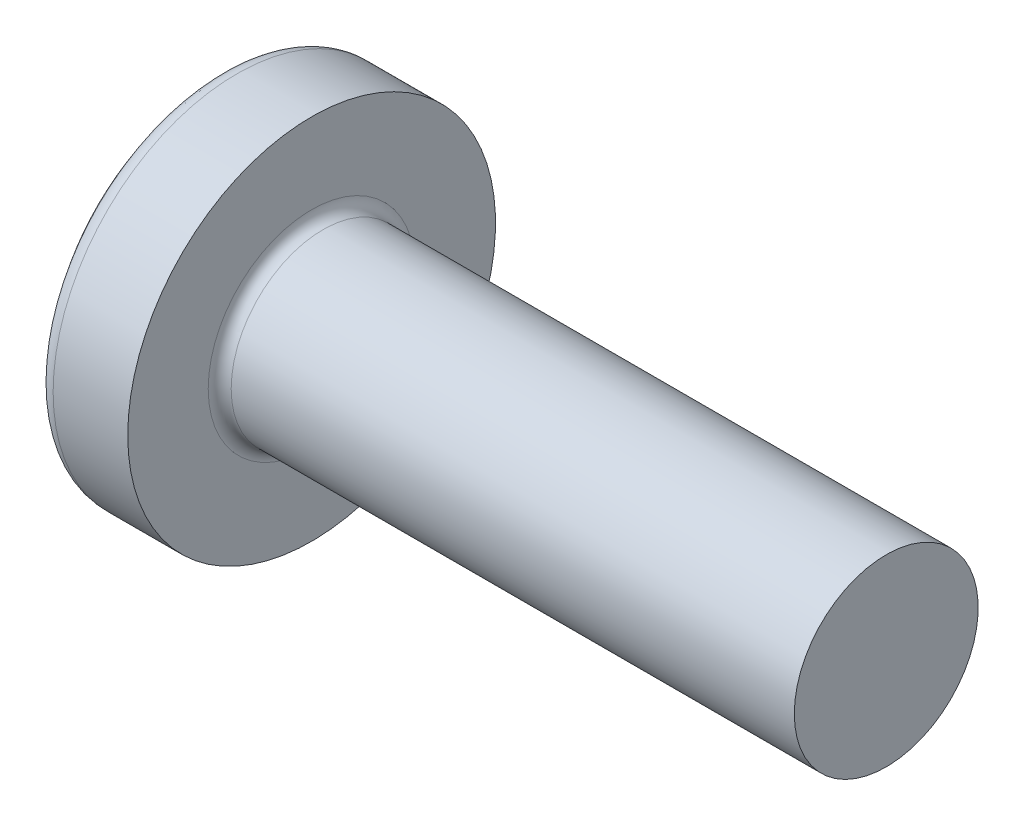
ISO-10303-21;
HEADER;
FILE_DESCRIPTION(('STEP AP214'),'2;1');
FILE_NAME('part.step','',(''),(''),'','','');
FILE_SCHEMA(('AUTOMOTIVE_DESIGN { 1 0 10303 214 1 1 1 1 }'));
ENDSEC;
DATA;
#1=APPLICATION_CONTEXT('core data for automotive mechanical design processes');
#2=APPLICATION_PROTOCOL_DEFINITION('international standard','automotive_design',2000,#1);
#3=PRODUCT_CONTEXT('',#1,'mechanical');
#4=PRODUCT('Part','Part','',(#3));
#5=PRODUCT_RELATED_PRODUCT_CATEGORY('part','',(#4));
#6=PRODUCT_DEFINITION_FORMATION('','',#4);
#7=PRODUCT_DEFINITION_CONTEXT('part definition',#1,'design');
#8=PRODUCT_DEFINITION('design','',#6,#7);
#9=PRODUCT_DEFINITION_SHAPE('','',#8);
#10=(LENGTH_UNIT() NAMED_UNIT(*) SI_UNIT(.MILLI.,.METRE.));
#11=(NAMED_UNIT(*) PLANE_ANGLE_UNIT() SI_UNIT($,.RADIAN.));
#12=(NAMED_UNIT(*) SI_UNIT($,.STERADIAN.) SOLID_ANGLE_UNIT());
#13=UNCERTAINTY_MEASURE_WITH_UNIT(LENGTH_MEASURE(1.E-05),#10,'distance_accuracy_value','');
#14=(GEOMETRIC_REPRESENTATION_CONTEXT(3) GLOBAL_UNCERTAINTY_ASSIGNED_CONTEXT((#13)) GLOBAL_UNIT_ASSIGNED_CONTEXT((#10,
#11,#12)) REPRESENTATION_CONTEXT('',''));
#15=CARTESIAN_POINT('',(0.,0.,0.));
#16=DIRECTION('',(0.,0.,1.));
#17=DIRECTION('',(1.,0.,0.));
#18=AXIS2_PLACEMENT_3D('',#15,#16,#17);
#19=CARTESIAN_POINT('',(2.5,0.,0.));
#20=DIRECTION('',(-1.,0.,0.));
#21=DIRECTION('',(0.,1.,0.));
#22=AXIS2_PLACEMENT_3D('',#19,#20,#21);
#23=SPHERICAL_SURFACE('',#22,2.5);
#24=CARTESIAN_POINT('',(0.532633828839689,0.,0.));
#25=DIRECTION('',(-1.,0.,0.));
#26=DIRECTION('',(0.,0.,1.));
#27=AXIS2_PLACEMENT_3D('',#24,#25,#26);
#28=CIRCLE('',#27,1.54255319148936);
#29=CARTESIAN_POINT('',(0.532633828839689,0.,1.54255319148936));
#30=VERTEX_POINT('',#29);
#31=EDGE_CURVE('E241',#30,#30,#28,.T.);
#32=ORIENTED_EDGE('',*,*,#31,.T.);
#33=EDGE_LOOP('',(#32));
#34=FACE_BOUND('',#33,.T.);
#35=CARTESIAN_POINT('',(0.0348536438778161,0.,0.));
#36=DIRECTION('',(1.,0.,0.));
#37=DIRECTION('',(0.,0.,-1.));
#38=AXIS2_PLACEMENT_3D('',#35,#36,#37);
#39=CIRCLE('',#38,0.415996926548163);
#40=CARTESIAN_POINT('',(0.0348536438778156,-0.239999999999999,-0.339784406495528));
#41=VERTEX_POINT('',#40);
#42=CARTESIAN_POINT('',(0.0348536438778159,-0.339784406495529,-0.24));
#43=VERTEX_POINT('',#42);
#44=EDGE_CURVE('E377',#41,#43,#39,.F.);
#45=ORIENTED_EDGE('',*,*,#44,.F.);
#46=CARTESIAN_POINT('',(2.5,-0.24,0.));
#47=DIRECTION('',(0.,1.,0.));
#48=DIRECTION('',(0.,0.,1.));
#49=AXIS2_PLACEMENT_3D('',#46,#47,#48);
#50=CIRCLE('',#49,2.48845333490504);
#51=CARTESIAN_POINT('',(0.123613677820939,-0.239999999999997,-0.738368504041365));
#52=VERTEX_POINT('',#51);
#53=EDGE_CURVE('E303',#52,#41,#50,.T.);
#54=ORIENTED_EDGE('',*,*,#53,.F.);
#55=CARTESIAN_POINT('',(2.32172308413752,0.,0.357568235162189));
#56=DIRECTION('',(0.446197753347436,0.,-0.894934391398443));
#57=DIRECTION('',(-0.894934391398443,0.,-0.446197753347436));
#58=AXIS2_PLACEMENT_3D('',#55,#56,#57);
#59=CIRCLE('',#58,2.46786594013402);
#60=CARTESIAN_POINT('',(0.123613677820939,0.240000000000003,-0.738368504041364));
#61=VERTEX_POINT('',#60);
#62=EDGE_CURVE('E275',#52,#61,#59,.T.);
#63=ORIENTED_EDGE('',*,*,#62,.T.);
#64=CARTESIAN_POINT('',(2.5,0.24,0.));
#65=DIRECTION('',(0.,-1.,0.));
#66=DIRECTION('',(0.,0.,-1.));
#67=AXIS2_PLACEMENT_3D('',#64,#65,#66);
#68=CIRCLE('',#67,2.48845333490504);
#69=CARTESIAN_POINT('',(0.0348536438778155,0.240000000000001,-0.339784406495526));
#70=VERTEX_POINT('',#69);
#71=EDGE_CURVE('E330',#70,#61,#68,.T.);
#72=ORIENTED_EDGE('',*,*,#71,.F.);
#73=CARTESIAN_POINT('',(0.0348536438778159,0.339784406495528,-0.24));
#74=VERTEX_POINT('',#73);
#75=EDGE_CURVE('E396',#74,#70,#39,.F.);
#76=ORIENTED_EDGE('',*,*,#75,.F.);
#77=CARTESIAN_POINT('',(2.5,0.,-0.24));
#78=DIRECTION('',(0.,0.,1.));
#79=DIRECTION('',(0.,-1.,0.));
#80=AXIS2_PLACEMENT_3D('',#77,#78,#79);
#81=CIRCLE('',#80,2.48845333490504);
#82=CARTESIAN_POINT('',(0.12361367782094,0.738368504041364,-0.24));
#83=VERTEX_POINT('',#82);
#84=EDGE_CURVE('E269',#83,#74,#81,.T.);
#85=ORIENTED_EDGE('',*,*,#84,.F.);
#86=CARTESIAN_POINT('',(2.32172308413752,-0.357568235162189,0.));
#87=DIRECTION('',(0.446197753347436,0.894934391398443,0.));
#88=DIRECTION('',(-0.894934391398443,0.446197753347436,0.));
#89=AXIS2_PLACEMENT_3D('',#86,#87,#88);
#90=CIRCLE('',#89,2.46786594013402);
#91=CARTESIAN_POINT('',(0.12361367782094,0.738368504041364,0.24));
#92=VERTEX_POINT('',#91);
#93=EDGE_CURVE('E272',#83,#92,#90,.T.);
#94=ORIENTED_EDGE('',*,*,#93,.T.);
#95=CARTESIAN_POINT('',(2.5,0.,0.24));
#96=DIRECTION('',(0.,0.,-1.));
#97=DIRECTION('',(0.,1.,0.));
#98=AXIS2_PLACEMENT_3D('',#95,#96,#97);
#99=CIRCLE('',#98,2.48845333490504);
#100=CARTESIAN_POINT('',(0.0348536438778159,0.339784406495528,0.24));
#101=VERTEX_POINT('',#100);
#102=EDGE_CURVE('E265',#101,#92,#99,.T.);
#103=ORIENTED_EDGE('',*,*,#102,.F.);
#104=CARTESIAN_POINT('',(0.0348536438778156,0.239999999999999,0.339784406495528));
#105=VERTEX_POINT('',#104);
#106=EDGE_CURVE('E430',#105,#101,#39,.F.);
#107=ORIENTED_EDGE('',*,*,#106,.F.);
#108=CARTESIAN_POINT('',(0.12361367782094,0.239999999999997,0.738368504041365));
#109=VERTEX_POINT('',#108);
#110=EDGE_CURVE('E285',#109,#105,#68,.T.);
#111=ORIENTED_EDGE('',*,*,#110,.F.);
#112=CARTESIAN_POINT('',(2.32172308413752,0.,-0.357568235162189));
#113=DIRECTION('',(0.446197753347436,0.,0.894934391398443));
#114=DIRECTION('',(0.894934391398443,0.,-0.446197753347436));
#115=AXIS2_PLACEMENT_3D('',#112,#113,#114);
#116=CIRCLE('',#115,2.46786594013402);
#117=CARTESIAN_POINT('',(0.12361367782094,-0.240000000000002,0.738368504041363));
#118=VERTEX_POINT('',#117);
#119=EDGE_CURVE('E52',#109,#118,#116,.T.);
#120=ORIENTED_EDGE('',*,*,#119,.T.);
#121=CARTESIAN_POINT('',(0.0348536438778149,-0.240000000000001,0.339784406495527));
#122=VERTEX_POINT('',#121);
#123=EDGE_CURVE('E282',#122,#118,#50,.T.);
#124=ORIENTED_EDGE('',*,*,#123,.F.);
#125=CARTESIAN_POINT('',(0.0348536438778159,-0.33978440649553,0.24));
#126=VERTEX_POINT('',#125);
#127=EDGE_CURVE('E395',#126,#122,#39,.F.);
#128=ORIENTED_EDGE('',*,*,#127,.F.);
#129=CARTESIAN_POINT('',(0.123613677820939,-0.738368504041364,0.24));
#130=VERTEX_POINT('',#129);
#131=EDGE_CURVE('E266',#130,#126,#99,.T.);
#132=ORIENTED_EDGE('',*,*,#131,.F.);
#133=CARTESIAN_POINT('',(2.32172308413752,0.357568235162189,0.));
#134=DIRECTION('',(0.446197753347436,-0.894934391398443,0.));
#135=DIRECTION('',(0.894934391398443,0.446197753347436,0.));
#136=AXIS2_PLACEMENT_3D('',#133,#134,#135);
#137=CIRCLE('',#136,2.46786594013402);
#138=CARTESIAN_POINT('',(0.123613677820939,-0.738368504041364,-0.24));
#139=VERTEX_POINT('',#138);
#140=EDGE_CURVE('E262',#130,#139,#137,.T.);
#141=ORIENTED_EDGE('',*,*,#140,.T.);
#142=EDGE_CURVE('E67',#43,#139,#81,.T.);
#143=ORIENTED_EDGE('',*,*,#142,.F.);
#144=EDGE_LOOP('',(#45,#54,#63,#72,#76,#85,#94,#103,#107,#111,#120,#124,#128,#132,#141,#143));
#145=FACE_BOUND('',#144,.T.);
#146=ADVANCED_FACE('F39',(#34,#145),#23,.T.);
#147=CARTESIAN_POINT('',(0.,0.799999999999999,-0.24));
#148=DIRECTION('',(0.,0.,1.));
#149=DIRECTION('',(0.,-1.,0.));
#150=AXIS2_PLACEMENT_3D('',#147,#148,#149);
#151=PLANE('',#150);
#152=ORIENTED_EDGE('',*,*,#84,.T.);
#153=CARTESIAN_POINT('',(-0.629305626090503,0.395285037112982,-0.24));
#154=CARTESIAN_POINT('',(-0.502245440869323,0.384885761504805,-0.24));
#155=CARTESIAN_POINT('',(-0.375193303991233,0.374386041200533,-0.24));
#156=CARTESIAN_POINT('',(-0.121109362358296,0.353102592236972,-0.24));
#157=CARTESIAN_POINT('',(0.00592244174754027,0.342318855839852,-0.24));
#158=CARTESIAN_POINT('',(0.259954553132912,0.320384813741064,-0.24));
#159=CARTESIAN_POINT('',(0.386954860411928,0.309234508033358,-0.24));
#160=CARTESIAN_POINT('',(0.640908035068629,0.286428502217992,-0.24));
#161=CARTESIAN_POINT('',(0.767860903211905,0.274772810656204,-0.24));
#162=CARTESIAN_POINT('',(1.02740505364566,0.25019581365541,-0.24));
#163=CARTESIAN_POINT('',(1.15999322223085,0.237241167273189,-0.24));
#164=CARTESIAN_POINT('',(1.35878055743685,0.216851377657759,-0.24));
#165=CARTESIAN_POINT('',(1.42502853887617,0.20989499214793,-0.24));
#166=CARTESIAN_POINT('',(1.55747716895957,0.195536747895866,-0.24));
#167=CARTESIAN_POINT('',(1.62367781680681,0.188134881824937,-0.24));
#168=CARTESIAN_POINT('',(1.6898463142949,0.180447253558895,-0.24));
#169=B_SPLINE_CURVE_WITH_KNOTS('',3,(#153,#154,#155,#156,#157,#158,#159,#160,#161,#162,#163,
#164,#165,#166,#167,#168),.UNSPECIFIED.,.F.,.F.,(4,2,2,2,2,2,2,4),(0.,0.382455333743983,
0.764921098031735,1.14738686861956,1.52984617438513,1.92950045825534,2.12933578679649,
2.32917440376971),.UNSPECIFIED.);
#170=CARTESIAN_POINT('',(0.9,0.262259890185289,-0.24));
#171=VERTEX_POINT('',#170);
#172=EDGE_CURVE('E417',#74,#171,#169,.T.);
#173=ORIENTED_EDGE('',*,*,#172,.T.);
#174=DIRECTION('',(0.,1.,0.));
#175=VECTOR('',#174,1.);
#176=CARTESIAN_POINT('',(0.9,-0.351276627792593,-0.24));
#177=LINE('',#176,#175);
#178=CARTESIAN_POINT('',(0.9,0.351276627792593,-0.24));
#179=VERTEX_POINT('',#178);
#180=EDGE_CURVE('E359',#171,#179,#177,.T.);
#181=ORIENTED_EDGE('',*,*,#180,.T.);
#182=DIRECTION('',(0.894934391398443,-0.446197753347436,0.));
#183=VECTOR('',#182,1.);
#184=CARTESIAN_POINT('',(0.,0.8,-0.24));
#185=LINE('',#184,#183);
#186=EDGE_CURVE('E242',#83,#179,#185,.T.);
#187=ORIENTED_EDGE('',*,*,#186,.F.);
#188=EDGE_LOOP('',(#152,#173,#181,#187));
#189=FACE_BOUND('',#188,.T.);
#190=ADVANCED_FACE('F197',(#189),#151,.T.);
#191=CARTESIAN_POINT('',(0.9,-0.351276627792593,-0.24));
#192=VERTEX_POINT('',#191);
#193=CARTESIAN_POINT('',(0.9,-0.262259890185289,-0.24));
#194=VERTEX_POINT('',#193);
#195=EDGE_CURVE('E250',#192,#194,#177,.T.);
#196=ORIENTED_EDGE('',*,*,#195,.T.);
#197=CARTESIAN_POINT('',(-0.629305630567792,-0.395285037479254,-0.24));
#198=CARTESIAN_POINT('',(-0.502245444906562,-0.384885761837513,-0.24));
#199=CARTESIAN_POINT('',(-0.375193307588421,-0.374386041499476,-0.24));
#200=CARTESIAN_POINT('',(-0.121109365075989,-0.353102592467066,-0.24));
#201=CARTESIAN_POINT('',(0.0059224394692922,-0.342318856034865,-0.24));
#202=CARTESIAN_POINT('',(0.259954552394605,-0.320384813806507,-0.24));
#203=CARTESIAN_POINT('',(0.386954860773954,-0.309234508002403,-0.24));
#204=CARTESIAN_POINT('',(0.640908037631128,-0.28642850198631,-0.24));
#205=CARTESIAN_POINT('',(0.767860906874543,-0.274772810320191,-0.24));
#206=CARTESIAN_POINT('',(1.02740503497565,-0.250195815411899,-0.24));
#207=CARTESIAN_POINT('',(1.15999318014165,-0.237241171372315,-0.24));
#208=CARTESIAN_POINT('',(1.35878048026027,-0.216851385682782,-0.24));
#209=CARTESIAN_POINT('',(1.42502845000983,-0.209895001550345,-0.24));
#210=CARTESIAN_POINT('',(1.5574770567395,-0.195536760284767,-0.24));
#211=CARTESIAN_POINT('',(1.62367769292277,-0.188134895822941,-0.24));
#212=CARTESIAN_POINT('',(1.68984617876649,-0.180447269328965,-0.24));
#213=B_SPLINE_CURVE_WITH_KNOTS('',3,(#197,#198,#199,#200,#201,#202,#203,#204,#205,#206,#207,
#208,#209,#210,#211,#212),.UNSPECIFIED.,.F.,.F.,(4,2,2,2,2,2,2,4),(0.,0.382455335067977,
0.764921100678223,1.14738687457974,1.52984618366023,1.92950039692502,2.12933569015819,
2.32917427182043),.UNSPECIFIED.);
#214=EDGE_CURVE('E394',#194,#43,#213,.F.);
#215=ORIENTED_EDGE('',*,*,#214,.T.);
#216=ORIENTED_EDGE('',*,*,#142,.T.);
#217=DIRECTION('',(0.894934391398443,0.446197753347436,0.));
#218=VECTOR('',#217,1.);
#219=CARTESIAN_POINT('',(0.,-0.8,-0.24));
#220=LINE('',#219,#218);
#221=EDGE_CURVE('E333',#139,#192,#220,.T.);
#222=ORIENTED_EDGE('',*,*,#221,.T.);
#223=EDGE_LOOP('',(#196,#215,#216,#222));
#224=FACE_BOUND('',#223,.T.);
#225=ADVANCED_FACE('F203',(#224),#151,.T.);
#226=CARTESIAN_POINT('',(0.,-0.799999999999999,0.24));
#227=DIRECTION('',(0.,0.,-1.));
#228=DIRECTION('',(0.,1.,0.));
#229=AXIS2_PLACEMENT_3D('',#226,#227,#228);
#230=PLANE('',#229);
#231=DIRECTION('',(0.,-1.,0.));
#232=VECTOR('',#231,1.);
#233=CARTESIAN_POINT('',(0.9,0.351276627792594,0.24));
#234=LINE('',#233,#232);
#235=CARTESIAN_POINT('',(0.9,0.351276627792594,0.24));
#236=VERTEX_POINT('',#235);
#237=CARTESIAN_POINT('',(0.9,0.262259890185289,0.24));
#238=VERTEX_POINT('',#237);
#239=EDGE_CURVE('E342',#236,#238,#234,.T.);
#240=ORIENTED_EDGE('',*,*,#239,.T.);
#241=CARTESIAN_POINT('',(-0.629305626090504,0.395285037112982,0.24));
#242=CARTESIAN_POINT('',(-0.502245440869323,0.384885761504805,0.24));
#243=CARTESIAN_POINT('',(-0.375193303991233,0.374386041200533,0.24));
#244=CARTESIAN_POINT('',(-0.121109362358297,0.353102592236972,0.24));
#245=CARTESIAN_POINT('',(0.00592244174753989,0.342318855839852,0.24));
#246=CARTESIAN_POINT('',(0.259954553132912,0.320384813741064,0.24));
#247=CARTESIAN_POINT('',(0.386954860411928,0.309234508033358,0.24));
#248=CARTESIAN_POINT('',(0.640908035068629,0.286428502217992,0.24));
#249=CARTESIAN_POINT('',(0.767860903211904,0.274772810656204,0.24));
#250=CARTESIAN_POINT('',(1.02740505364567,0.250195813655409,0.24));
#251=CARTESIAN_POINT('',(1.15999322223086,0.237241167273188,0.24));
#252=CARTESIAN_POINT('',(1.35878055743687,0.216851377657757,0.24));
#253=CARTESIAN_POINT('',(1.42502853887619,0.209894992147928,0.24));
#254=CARTESIAN_POINT('',(1.5574771689596,0.195536747895863,0.24));
#255=CARTESIAN_POINT('',(1.62367781680684,0.188134881824934,0.24));
#256=CARTESIAN_POINT('',(1.68984631429493,0.180447253558891,0.24));
#257=B_SPLINE_CURVE_WITH_KNOTS('',3,(#241,#242,#243,#244,#245,#246,#247,#248,#249,#250,#251,
#252,#253,#254,#255,#256),.UNSPECIFIED.,.F.,.F.,(4,2,2,2,2,2,2,4),(0.,0.382455333743983,
0.764921098031735,1.14738686861956,1.52984617438513,1.92950045825536,2.12933578679651,
2.32917440376974),.UNSPECIFIED.);
#258=EDGE_CURVE('E431',#238,#101,#257,.F.);
#259=ORIENTED_EDGE('',*,*,#258,.T.);
#260=ORIENTED_EDGE('',*,*,#102,.T.);
#261=DIRECTION('',(0.894934391398443,-0.446197753347436,0.));
#262=VECTOR('',#261,1.);
#263=CARTESIAN_POINT('',(0.,0.8,0.24));
#264=LINE('',#263,#262);
#265=EDGE_CURVE('E247',#92,#236,#264,.T.);
#266=ORIENTED_EDGE('',*,*,#265,.T.);
#267=EDGE_LOOP('',(#240,#259,#260,#266));
#268=FACE_BOUND('',#267,.T.);
#269=ADVANCED_FACE('F413',(#268),#230,.T.);
#270=ORIENTED_EDGE('',*,*,#131,.T.);
#271=CARTESIAN_POINT('',(-0.629305630567792,-0.395285037479254,0.24));
#272=CARTESIAN_POINT('',(-0.502245444906562,-0.384885761837513,0.24));
#273=CARTESIAN_POINT('',(-0.375193307588421,-0.374386041499476,0.24));
#274=CARTESIAN_POINT('',(-0.121109365075988,-0.353102592467066,0.24));
#275=CARTESIAN_POINT('',(0.00592243946929231,-0.342318856034865,0.24));
#276=CARTESIAN_POINT('',(0.259954552394605,-0.320384813806507,0.24));
#277=CARTESIAN_POINT('',(0.386954860773954,-0.309234508002403,0.24));
#278=CARTESIAN_POINT('',(0.640908037631128,-0.28642850198631,0.24));
#279=CARTESIAN_POINT('',(0.767860906874543,-0.274772810320191,0.24));
#280=CARTESIAN_POINT('',(1.02740503497567,-0.250195815411897,0.24));
#281=CARTESIAN_POINT('',(1.15999318014169,-0.237241171372312,0.24));
#282=CARTESIAN_POINT('',(1.35878048026033,-0.216851385682775,0.24));
#283=CARTESIAN_POINT('',(1.4250284500099,-0.209895001550338,0.24));
#284=CARTESIAN_POINT('',(1.55747705673959,-0.195536760284757,0.24));
#285=CARTESIAN_POINT('',(1.62367769292287,-0.18813489582293,0.24));
#286=CARTESIAN_POINT('',(1.6898461787666,-0.180447269328953,0.24));
#287=B_SPLINE_CURVE_WITH_KNOTS('',3,(#271,#272,#273,#274,#275,#276,#277,#278,#279,#280,#281,
#282,#283,#284,#285,#286),.UNSPECIFIED.,.F.,.F.,(4,2,2,2,2,2,2,4),(0.,0.382455335067977,
0.764921100678223,1.14738687457974,1.52984618366023,1.92950039692507,2.12933569015827,
2.32917427182054),.UNSPECIFIED.);
#288=CARTESIAN_POINT('',(0.9,-0.262259890185289,0.24));
#289=VERTEX_POINT('',#288);
#290=EDGE_CURVE('E450',#126,#289,#287,.T.);
#291=ORIENTED_EDGE('',*,*,#290,.T.);
#292=CARTESIAN_POINT('',(0.9,-0.351276627792593,0.24));
#293=VERTEX_POINT('',#292);
#294=EDGE_CURVE('E344',#289,#293,#234,.T.);
#295=ORIENTED_EDGE('',*,*,#294,.T.);
#296=DIRECTION('',(0.894934391398443,0.446197753347436,0.));
#297=VECTOR('',#296,1.);
#298=CARTESIAN_POINT('',(0.,-0.8,0.24));
#299=LINE('',#298,#297);
#300=EDGE_CURVE('E335',#130,#293,#299,.T.);
#301=ORIENTED_EDGE('',*,*,#300,.F.);
#302=EDGE_LOOP('',(#270,#291,#295,#301));
#303=FACE_BOUND('',#302,.T.);
#304=ADVANCED_FACE('F511',(#303),#230,.T.);
#305=CARTESIAN_POINT('',(0.,0.8,0.24));
#306=DIRECTION('',(0.446197753347436,0.894934391398443,0.));
#307=DIRECTION('',(-0.894934391398443,0.446197753347436,0.));
#308=AXIS2_PLACEMENT_3D('',#305,#306,#307);
#309=PLANE('',#308);
#310=CARTESIAN_POINT('',(1.51667990224654,0.0438114218941497,0.));
#311=DIRECTION('',(0.446197753347436,0.894934391398443,0.));
#312=DIRECTION('',(-0.894934391398443,0.446197753347436,0.));
#313=AXIS2_PLACEMENT_3D('',#310,#311,#312);
#314=ELLIPSE('',#313,0.700087658673245,0.309289972496479);
#315=CARTESIAN_POINT('',(0.9,0.351276627792594,0.0546349775021766));
#316=VERTEX_POINT('',#315);
#317=CARTESIAN_POINT('',(0.9,0.351276627792594,-0.0546349775021767));
#318=VERTEX_POINT('',#317);
#319=EDGE_CURVE('E308',#316,#318,#314,.F.);
#320=ORIENTED_EDGE('',*,*,#319,.F.);
#321=DIRECTION('',(0.,0.,-1.));
#322=VECTOR('',#321,1.);
#323=CARTESIAN_POINT('',(0.9,0.351276627792594,0.24));
#324=LINE('',#323,#322);
#325=EDGE_CURVE('E345',#236,#316,#324,.T.);
#326=ORIENTED_EDGE('',*,*,#325,.F.);
#327=ORIENTED_EDGE('',*,*,#265,.F.);
#328=ORIENTED_EDGE('',*,*,#93,.F.);
#329=ORIENTED_EDGE('',*,*,#186,.T.);
#330=EDGE_CURVE('E347',#318,#179,#324,.T.);
#331=ORIENTED_EDGE('',*,*,#330,.F.);
#332=EDGE_LOOP('',(#320,#326,#327,#328,#329,#331));
#333=FACE_BOUND('',#332,.T.);
#334=ADVANCED_FACE('F411',(#333),#309,.F.);
#335=CARTESIAN_POINT('',(0.9,-0.351276627792593,-0.24));
#336=DIRECTION('',(0.446197753347436,-0.894934391398443,0.));
#337=DIRECTION('',(0.894934391398443,0.446197753347436,0.));
#338=AXIS2_PLACEMENT_3D('',#335,#336,#337);
#339=PLANE('',#338);
#340=CARTESIAN_POINT('',(1.51667990224654,-0.0438114218941493,0.));
#341=DIRECTION('',(0.446197753347436,-0.894934391398443,0.));
#342=DIRECTION('',(-0.894934391398443,-0.446197753347436,0.));
#343=AXIS2_PLACEMENT_3D('',#340,#341,#342);
#344=ELLIPSE('',#343,0.700087658673246,0.30928997249648);
#345=CARTESIAN_POINT('',(0.9,-0.351276627792594,-0.0546349775021784));
#346=VERTEX_POINT('',#345);
#347=CARTESIAN_POINT('',(0.9,-0.351276627792594,0.0546349775021784));
#348=VERTEX_POINT('',#347);
#349=EDGE_CURVE('E455',#346,#348,#344,.F.);
#350=ORIENTED_EDGE('',*,*,#349,.F.);
#351=DIRECTION('',(0.,0.,1.));
#352=VECTOR('',#351,1.);
#353=CARTESIAN_POINT('',(0.9,-0.351276627792593,-0.24));
#354=LINE('',#353,#352);
#355=EDGE_CURVE('E338',#192,#346,#354,.T.);
#356=ORIENTED_EDGE('',*,*,#355,.F.);
#357=ORIENTED_EDGE('',*,*,#221,.F.);
#358=ORIENTED_EDGE('',*,*,#140,.F.);
#359=ORIENTED_EDGE('',*,*,#300,.T.);
#360=EDGE_CURVE('E341',#348,#293,#354,.T.);
#361=ORIENTED_EDGE('',*,*,#360,.F.);
#362=EDGE_LOOP('',(#350,#356,#357,#358,#359,#361));
#363=FACE_BOUND('',#362,.T.);
#364=ADVANCED_FACE('F503',(#363),#339,.F.);
#365=CARTESIAN_POINT('',(0.9,-0.351276627792593,-0.24));
#366=DIRECTION('',(1.,0.,0.));
#367=DIRECTION('',(0.,0.,-1.));
#368=AXIS2_PLACEMENT_3D('',#365,#366,#367);
#369=PLANE('',#368);
#370=CARTESIAN_POINT('',(0.9,0.,0.));
#371=DIRECTION('',(-1.,0.,0.));
#372=DIRECTION('',(0.,0.,1.));
#373=AXIS2_PLACEMENT_3D('',#370,#371,#372);
#374=CIRCLE('',#373,0.3555);
#375=CARTESIAN_POINT('',(0.9,-0.0546349775021792,-0.351276627792594));
#376=VERTEX_POINT('',#375);
#377=CARTESIAN_POINT('',(0.9,-0.239999999999999,-0.26225989018529));
#378=VERTEX_POINT('',#377);
#379=EDGE_CURVE('E59',#376,#378,#374,.T.);
#380=ORIENTED_EDGE('',*,*,#379,.F.);
#381=DIRECTION('',(0.,-1.,0.));
#382=VECTOR('',#381,1.);
#383=CARTESIAN_POINT('',(0.9,0.240000000000001,-0.351276627792592));
#384=LINE('',#383,#382);
#385=CARTESIAN_POINT('',(0.9,-0.239999999999999,-0.351276627792594));
#386=VERTEX_POINT('',#385);
#387=EDGE_CURVE('E318',#376,#386,#384,.T.);
#388=ORIENTED_EDGE('',*,*,#387,.T.);
#389=DIRECTION('',(0.,0.,-1.));
#390=VECTOR('',#389,1.);
#391=CARTESIAN_POINT('',(0.9,-0.240000000000001,0.351276627792593));
#392=LINE('',#391,#390);
#393=EDGE_CURVE('E322',#378,#386,#392,.T.);
#394=ORIENTED_EDGE('',*,*,#393,.F.);
#395=EDGE_LOOP('',(#380,#388,#394));
#396=FACE_BOUND('',#395,.T.);
#397=ADVANCED_FACE('F383',(#396),#369,.F.);
#398=EDGE_CURVE('E388',#194,#346,#374,.T.);
#399=ORIENTED_EDGE('',*,*,#398,.F.);
#400=ORIENTED_EDGE('',*,*,#195,.F.);
#401=ORIENTED_EDGE('',*,*,#355,.T.);
#402=EDGE_LOOP('',(#399,#400,#401));
#403=FACE_BOUND('',#402,.T.);
#404=ADVANCED_FACE('F510',(#403),#369,.F.);
#405=EDGE_CURVE('E518',#348,#289,#374,.T.);
#406=ORIENTED_EDGE('',*,*,#405,.F.);
#407=ORIENTED_EDGE('',*,*,#360,.T.);
#408=ORIENTED_EDGE('',*,*,#294,.F.);
#409=EDGE_LOOP('',(#406,#407,#408));
#410=FACE_BOUND('',#409,.T.);
#411=ADVANCED_FACE('F499',(#410),#369,.F.);
#412=CARTESIAN_POINT('',(0.9,-0.240000000000001,0.262259890185289));
#413=VERTEX_POINT('',#412);
#414=CARTESIAN_POINT('',(0.9,-0.05463497750218,0.351276627792593));
#415=VERTEX_POINT('',#414);
#416=EDGE_CURVE('E486',#413,#415,#374,.T.);
#417=ORIENTED_EDGE('',*,*,#416,.F.);
#418=CARTESIAN_POINT('',(0.9,-0.240000000000001,0.351276627792593));
#419=VERTEX_POINT('',#418);
#420=EDGE_CURVE('E319',#419,#413,#392,.T.);
#421=ORIENTED_EDGE('',*,*,#420,.F.);
#422=DIRECTION('',(0.,1.,0.));
#423=VECTOR('',#422,1.);
#424=CARTESIAN_POINT('',(0.9,-0.240000000000001,0.351276627792593));
#425=LINE('',#424,#423);
#426=EDGE_CURVE('E323',#419,#415,#425,.T.);
#427=ORIENTED_EDGE('',*,*,#426,.T.);
#428=EDGE_LOOP('',(#417,#421,#427));
#429=FACE_BOUND('',#428,.T.);
#430=ADVANCED_FACE('F484',(#429),#369,.F.);
#431=CARTESIAN_POINT('',(0.9,0.0546349775021775,0.351276627792594));
#432=VERTEX_POINT('',#431);
#433=CARTESIAN_POINT('',(0.9,0.239999999999999,0.26225989018529));
#434=VERTEX_POINT('',#433);
#435=EDGE_CURVE('E389',#432,#434,#374,.T.);
#436=ORIENTED_EDGE('',*,*,#435,.F.);
#437=CARTESIAN_POINT('',(0.9,0.239999999999999,0.351276627792594));
#438=VERTEX_POINT('',#437);
#439=EDGE_CURVE('E326',#432,#438,#425,.T.);
#440=ORIENTED_EDGE('',*,*,#439,.T.);
#441=DIRECTION('',(0.,0.,1.));
#442=VECTOR('',#441,1.);
#443=CARTESIAN_POINT('',(0.9,0.240000000000001,-0.351276627792592));
#444=LINE('',#443,#442);
#445=EDGE_CURVE('E300',#434,#438,#444,.T.);
#446=ORIENTED_EDGE('',*,*,#445,.F.);
#447=EDGE_LOOP('',(#436,#440,#446));
#448=FACE_BOUND('',#447,.T.);
#449=ADVANCED_FACE('F492',(#448),#369,.F.);
#450=EDGE_CURVE('E469',#238,#316,#374,.T.);
#451=ORIENTED_EDGE('',*,*,#450,.F.);
#452=ORIENTED_EDGE('',*,*,#239,.F.);
#453=ORIENTED_EDGE('',*,*,#325,.T.);
#454=EDGE_LOOP('',(#451,#452,#453));
#455=FACE_BOUND('',#454,.T.);
#456=ADVANCED_FACE('F494',(#455),#369,.F.);
#457=EDGE_CURVE('E467',#318,#171,#374,.T.);
#458=ORIENTED_EDGE('',*,*,#457,.F.);
#459=ORIENTED_EDGE('',*,*,#330,.T.);
#460=ORIENTED_EDGE('',*,*,#180,.F.);
#461=EDGE_LOOP('',(#458,#459,#460));
#462=FACE_BOUND('',#461,.T.);
#463=ADVANCED_FACE('F441',(#462),#369,.F.);
#464=CARTESIAN_POINT('',(0.,-0.239999999999997,-0.8));
#465=DIRECTION('',(0.,1.,0.));
#466=DIRECTION('',(0.,0.,1.));
#467=AXIS2_PLACEMENT_3D('',#464,#465,#466);
#468=PLANE('',#467);
#469=ORIENTED_EDGE('',*,*,#420,.T.);
#470=CARTESIAN_POINT('',(-0.629305626090504,-0.240000000000001,0.395285037112981));
#471=CARTESIAN_POINT('',(-0.502245440869323,-0.240000000000001,0.384885761504804));
#472=CARTESIAN_POINT('',(-0.375193303991233,-0.240000000000001,0.374386041200532));
#473=CARTESIAN_POINT('',(-0.121109362358297,-0.240000000000001,0.353102592236971));
#474=CARTESIAN_POINT('',(0.00592244174753978,-0.240000000000001,0.342318855839851));
#475=CARTESIAN_POINT('',(0.259954553132912,-0.240000000000001,0.320384813741063));
#476=CARTESIAN_POINT('',(0.386954860411928,-0.240000000000001,0.309234508033357));
#477=CARTESIAN_POINT('',(0.640908035068629,-0.240000000000001,0.286428502217992));
#478=CARTESIAN_POINT('',(0.767860903211904,-0.240000000000001,0.274772810656204));
#479=CARTESIAN_POINT('',(1.02740505364567,-0.240000000000001,0.250195813655408));
#480=CARTESIAN_POINT('',(1.15999322223087,-0.240000000000001,0.237241167273186));
#481=CARTESIAN_POINT('',(1.35878055743688,-0.240000000000001,0.216851377657755));
#482=CARTESIAN_POINT('',(1.42502853887621,-0.240000000000001,0.209894992147925));
#483=CARTESIAN_POINT('',(1.55747716895962,-0.24,0.19553674789586));
#484=CARTESIAN_POINT('',(1.62367781680687,-0.24,0.18813488182493));
#485=CARTESIAN_POINT('',(1.68984631429496,-0.24,0.180447253558887));
#486=B_SPLINE_CURVE_WITH_KNOTS('',3,(#470,#471,#472,#473,#474,#475,#476,#477,#478,#479,#480,
#481,#482,#483,#484,#485),.UNSPECIFIED.,.F.,.F.,(4,2,2,2,2,2,2,4),(0.,0.382455333743983,
0.764921098031735,1.14738686861956,1.52984617438513,1.92950045825537,2.12933578679653,
2.32917440376977),.UNSPECIFIED.);
#487=EDGE_CURVE('E444',#413,#122,#486,.F.);
#488=ORIENTED_EDGE('',*,*,#487,.T.);
#489=ORIENTED_EDGE('',*,*,#123,.T.);
#490=DIRECTION('',(0.894934391398443,0.,-0.446197753347436));
#491=VECTOR('',#490,1.);
#492=CARTESIAN_POINT('',(0.,-0.240000000000003,0.799999999999999));
#493=LINE('',#492,#491);
#494=EDGE_CURVE('E295',#118,#419,#493,.T.);
#495=ORIENTED_EDGE('',*,*,#494,.T.);
#496=EDGE_LOOP('',(#469,#488,#489,#495));
#497=FACE_BOUND('',#496,.T.);
#498=ADVANCED_FACE('F232',(#497),#468,.T.);
#499=CARTESIAN_POINT('',(0.,0.239999999999997,0.8));
#500=DIRECTION('',(0.,-1.,0.));
#501=DIRECTION('',(0.,0.,-1.));
#502=AXIS2_PLACEMENT_3D('',#499,#500,#501);
#503=PLANE('',#502);
#504=ORIENTED_EDGE('',*,*,#110,.T.);
#505=CARTESIAN_POINT('',(-0.629305630567792,0.239999999999999,0.395285037479255));
#506=CARTESIAN_POINT('',(-0.502245444906562,0.239999999999999,0.384885761837514));
#507=CARTESIAN_POINT('',(-0.37519330758842,0.239999999999999,0.374386041499476));
#508=CARTESIAN_POINT('',(-0.121109365075988,0.239999999999999,0.353102592467067));
#509=CARTESIAN_POINT('',(0.0059224394692925,0.239999999999999,0.342318856034866));
#510=CARTESIAN_POINT('',(0.259954552394605,0.239999999999999,0.320384813806507));
#511=CARTESIAN_POINT('',(0.386954860773954,0.239999999999999,0.309234508002404));
#512=CARTESIAN_POINT('',(0.640908037631128,0.239999999999999,0.286428501986311));
#513=CARTESIAN_POINT('',(0.767860906874543,0.239999999999999,0.274772810320191));
#514=CARTESIAN_POINT('',(1.02740503497566,0.239999999999999,0.250195815411899));
#515=CARTESIAN_POINT('',(1.15999318014166,0.239999999999999,0.237241171372315));
#516=CARTESIAN_POINT('',(1.35878048026028,0.239999999999999,0.216851385682781));
#517=CARTESIAN_POINT('',(1.42502845000985,0.239999999999999,0.209895001550344));
#518=CARTESIAN_POINT('',(1.55747705673952,0.239999999999999,0.195536760284766));
#519=CARTESIAN_POINT('',(1.6236776929228,0.239999999999999,0.188134895822939));
#520=CARTESIAN_POINT('',(1.68984617876652,0.239999999999999,0.180447269328963));
#521=B_SPLINE_CURVE_WITH_KNOTS('',3,(#505,#506,#507,#508,#509,#510,#511,#512,#513,#514,#515,
#516,#517,#518,#519,#520),.UNSPECIFIED.,.F.,.F.,(4,2,2,2,2,2,2,4),(0.,0.382455335067977,
0.764921100678223,1.14738687457974,1.52984618366023,1.92950039692503,2.12933569015821,
2.32917427182045),.UNSPECIFIED.);
#522=EDGE_CURVE('E425',#105,#434,#521,.T.);
#523=ORIENTED_EDGE('',*,*,#522,.T.);
#524=ORIENTED_EDGE('',*,*,#445,.T.);
#525=DIRECTION('',(0.894934391398443,0.,-0.446197753347436));
#526=VECTOR('',#525,1.);
#527=CARTESIAN_POINT('',(0.,0.239999999999997,0.800000000000001));
#528=LINE('',#527,#526);
#529=EDGE_CURVE('E293',#109,#438,#528,.T.);
#530=ORIENTED_EDGE('',*,*,#529,.F.);
#531=EDGE_LOOP('',(#504,#523,#524,#530));
#532=FACE_BOUND('',#531,.T.);
#533=ADVANCED_FACE('F297',(#532),#503,.T.);
#534=CARTESIAN_POINT('',(0.,-0.240000000000003,0.799999999999999));
#535=DIRECTION('',(0.446197753347436,0.,0.894934391398443));
#536=DIRECTION('',(-0.894934391398443,0.,0.446197753347436));
#537=AXIS2_PLACEMENT_3D('',#534,#535,#536);
#538=PLANE('',#537);
#539=CARTESIAN_POINT('',(1.51667990224654,0.,0.0438114218941497));
#540=DIRECTION('',(0.446197753347436,0.,0.894934391398443));
#541=DIRECTION('',(-0.894934391398443,0.,0.446197753347436));
#542=AXIS2_PLACEMENT_3D('',#539,#540,#541);
#543=ELLIPSE('',#542,0.700087658673245,0.309289972496479);
#544=EDGE_CURVE('E423',#415,#432,#543,.F.);
#545=ORIENTED_EDGE('',*,*,#544,.F.);
#546=ORIENTED_EDGE('',*,*,#426,.F.);
#547=ORIENTED_EDGE('',*,*,#494,.F.);
#548=ORIENTED_EDGE('',*,*,#119,.F.);
#549=ORIENTED_EDGE('',*,*,#529,.T.);
#550=ORIENTED_EDGE('',*,*,#439,.F.);
#551=EDGE_LOOP('',(#545,#546,#547,#548,#549,#550));
#552=FACE_BOUND('',#551,.T.);
#553=ADVANCED_FACE('F291',(#552),#538,.F.);
#554=CARTESIAN_POINT('',(0.9,0.240000000000001,-0.351276627792592));
#555=DIRECTION('',(0.446197753347436,0.,-0.894934391398443));
#556=DIRECTION('',(0.894934391398443,0.,0.446197753347436));
#557=AXIS2_PLACEMENT_3D('',#554,#555,#556);
#558=PLANE('',#557);
#559=CARTESIAN_POINT('',(1.51667990224654,0.,-0.0438114218941493));
#560=DIRECTION('',(0.446197753347436,0.,-0.894934391398443));
#561=DIRECTION('',(-0.894934391398443,0.,-0.446197753347436));
#562=AXIS2_PLACEMENT_3D('',#559,#560,#561);
#563=ELLIPSE('',#562,0.700087658673246,0.30928997249648);
#564=CARTESIAN_POINT('',(0.9,0.0546349775021817,-0.351276627792593));
#565=VERTEX_POINT('',#564);
#566=EDGE_CURVE('E381',#565,#376,#563,.F.);
#567=ORIENTED_EDGE('',*,*,#566,.F.);
#568=CARTESIAN_POINT('',(0.9,0.240000000000001,-0.351276627792592));
#569=VERTEX_POINT('',#568);
#570=EDGE_CURVE('E315',#569,#565,#384,.T.);
#571=ORIENTED_EDGE('',*,*,#570,.F.);
#572=DIRECTION('',(0.894934391398443,0.,0.446197753347436));
#573=VECTOR('',#572,1.);
#574=CARTESIAN_POINT('',(0.,0.240000000000003,-0.799999999999999));
#575=LINE('',#574,#573);
#576=EDGE_CURVE('E305',#61,#569,#575,.T.);
#577=ORIENTED_EDGE('',*,*,#576,.F.);
#578=ORIENTED_EDGE('',*,*,#62,.F.);
#579=DIRECTION('',(0.894934391398443,0.,0.446197753347436));
#580=VECTOR('',#579,1.);
#581=CARTESIAN_POINT('',(0.,-0.239999999999997,-0.800000000000001));
#582=LINE('',#581,#580);
#583=EDGE_CURVE('E312',#52,#386,#582,.T.);
#584=ORIENTED_EDGE('',*,*,#583,.T.);
#585=ORIENTED_EDGE('',*,*,#387,.F.);
#586=EDGE_LOOP('',(#567,#571,#577,#578,#584,#585));
#587=FACE_BOUND('',#586,.T.);
#588=ADVANCED_FACE('F372',(#587),#558,.F.);
#589=CARTESIAN_POINT('',(0.9,0.240000000000001,-0.262259890185289));
#590=VERTEX_POINT('',#589);
#591=EDGE_CURVE('E327',#569,#590,#444,.T.);
#592=ORIENTED_EDGE('',*,*,#591,.T.);
#593=CARTESIAN_POINT('',(-0.629305626090503,0.240000000000001,-0.395285037112981));
#594=CARTESIAN_POINT('',(-0.502245440869323,0.240000000000001,-0.384885761504804));
#595=CARTESIAN_POINT('',(-0.375193303991233,0.240000000000001,-0.374386041200532));
#596=CARTESIAN_POINT('',(-0.121109362358296,0.240000000000001,-0.353102592236971));
#597=CARTESIAN_POINT('',(0.00592244174754019,0.240000000000001,-0.342318855839851));
#598=CARTESIAN_POINT('',(0.259954553132912,0.240000000000001,-0.320384813741063));
#599=CARTESIAN_POINT('',(0.386954860411928,0.240000000000001,-0.309234508033357));
#600=CARTESIAN_POINT('',(0.640908035068629,0.240000000000001,-0.286428502217991));
#601=CARTESIAN_POINT('',(0.767860903211905,0.240000000000001,-0.274772810656203));
#602=CARTESIAN_POINT('',(1.02740505364566,0.240000000000001,-0.250195813655409));
#603=CARTESIAN_POINT('',(1.15999322223085,0.240000000000001,-0.237241167273188));
#604=CARTESIAN_POINT('',(1.35878055743686,0.240000000000001,-0.216851377657757));
#605=CARTESIAN_POINT('',(1.42502853887618,0.240000000000001,-0.209894992147928));
#606=CARTESIAN_POINT('',(1.55747716895958,0.240000000000001,-0.195536747895864));
#607=CARTESIAN_POINT('',(1.62367781680682,0.240000000000001,-0.188134881824935));
#608=CARTESIAN_POINT('',(1.68984631429491,0.240000000000001,-0.180447253558892));
#609=B_SPLINE_CURVE_WITH_KNOTS('',3,(#593,#594,#595,#596,#597,#598,#599,#600,#601,#602,#603,
#604,#605,#606,#607,#608),.UNSPECIFIED.,.F.,.F.,(4,2,2,2,2,2,2,4),(0.,0.382455333743983,
0.764921098031735,1.14738686861956,1.52984617438513,1.92950045825535,2.1293357867965,
2.32917440376972),.UNSPECIFIED.);
#610=EDGE_CURVE('E368',#590,#70,#609,.F.);
#611=ORIENTED_EDGE('',*,*,#610,.T.);
#612=ORIENTED_EDGE('',*,*,#71,.T.);
#613=ORIENTED_EDGE('',*,*,#576,.T.);
#614=EDGE_LOOP('',(#592,#611,#612,#613));
#615=FACE_BOUND('',#614,.T.);
#616=ADVANCED_FACE('F230',(#615),#503,.T.);
#617=ORIENTED_EDGE('',*,*,#53,.T.);
#618=CARTESIAN_POINT('',(-0.629305626090504,-0.239999999999998,-0.395285037112983));
#619=CARTESIAN_POINT('',(-0.502245440869323,-0.239999999999998,-0.384885761504806));
#620=CARTESIAN_POINT('',(-0.375193303991233,-0.239999999999998,-0.374386041200534));
#621=CARTESIAN_POINT('',(-0.121109362358297,-0.239999999999999,-0.353102592236973));
#622=CARTESIAN_POINT('',(0.00592244174753989,-0.239999999999999,-0.342318855839853));
#623=CARTESIAN_POINT('',(0.259954553132912,-0.239999999999999,-0.320384813741065));
#624=CARTESIAN_POINT('',(0.386954860411928,-0.239999999999999,-0.309234508033359));
#625=CARTESIAN_POINT('',(0.640908035068629,-0.239999999999999,-0.286428502217993));
#626=CARTESIAN_POINT('',(0.767860903211904,-0.239999999999999,-0.274772810656205));
#627=CARTESIAN_POINT('',(1.02740505364567,-0.239999999999999,-0.25019581365541));
#628=CARTESIAN_POINT('',(1.15999322223087,-0.239999999999999,-0.237241167273188));
#629=CARTESIAN_POINT('',(1.35878055743688,-0.239999999999999,-0.216851377657757));
#630=CARTESIAN_POINT('',(1.42502853887621,-0.239999999999999,-0.209894992147927));
#631=CARTESIAN_POINT('',(1.55747716895962,-0.239999999999999,-0.195536747895862));
#632=CARTESIAN_POINT('',(1.62367781680686,-0.239999999999999,-0.188134881824932));
#633=CARTESIAN_POINT('',(1.68984631429496,-0.239999999999999,-0.180447253558889));
#634=B_SPLINE_CURVE_WITH_KNOTS('',3,(#618,#619,#620,#621,#622,#623,#624,#625,#626,#627,#628,
#629,#630,#631,#632,#633),.UNSPECIFIED.,.F.,.F.,(4,2,2,2,2,2,2,4),(0.,0.382455333743983,
0.764921098031735,1.14738686861956,1.52984617438513,1.92950045825537,2.12933578679653,
2.32917440376977),.UNSPECIFIED.);
#635=EDGE_CURVE('E11',#41,#378,#634,.T.);
#636=ORIENTED_EDGE('',*,*,#635,.T.);
#637=ORIENTED_EDGE('',*,*,#393,.T.);
#638=ORIENTED_EDGE('',*,*,#583,.F.);
#639=EDGE_LOOP('',(#617,#636,#637,#638));
#640=FACE_BOUND('',#639,.T.);
#641=ADVANCED_FACE('F225',(#640),#468,.T.);
#642=CARTESIAN_POINT('',(-25.4,0.,0.));
#643=DIRECTION('',(-1.,0.,0.));
#644=DIRECTION('',(0.,0.,1.));
#645=AXIS2_PLACEMENT_3D('',#642,#643,#644);
#646=CYLINDRICAL_SURFACE('',#645,0.8);
#647=CARTESIAN_POINT('',(1.4,0.,0.));
#648=DIRECTION('',(-1.,0.,0.));
#649=DIRECTION('',(0.,0.,1.));
#650=AXIS2_PLACEMENT_3D('',#647,#648,#649);
#651=CIRCLE('',#650,0.8);
#652=CARTESIAN_POINT('',(1.4,0.,0.8));
#653=VERTEX_POINT('',#652);
#654=EDGE_CURVE('E236',#653,#653,#651,.F.);
#655=ORIENTED_EDGE('',*,*,#654,.T.);
#656=EDGE_LOOP('',(#655));
#657=FACE_BOUND('',#656,.T.);
#658=CARTESIAN_POINT('',(6.3,0.,0.));
#659=DIRECTION('',(-1.,0.,0.));
#660=DIRECTION('',(0.,0.,1.));
#661=AXIS2_PLACEMENT_3D('',#658,#659,#660);
#662=CIRCLE('',#661,0.8);
#663=CARTESIAN_POINT('',(6.3,0.,0.8));
#664=VERTEX_POINT('',#663);
#665=EDGE_CURVE('E239',#664,#664,#662,.T.);
#666=ORIENTED_EDGE('',*,*,#665,.T.);
#667=EDGE_LOOP('',(#666));
#668=FACE_BOUND('',#667,.T.);
#669=ADVANCED_FACE('F222',(#657,#668),#646,.T.);
#670=CARTESIAN_POINT('',(1.3,0.8,0.));
#671=DIRECTION('',(-1.,0.,0.));
#672=DIRECTION('',(0.,0.,1.));
#673=AXIS2_PLACEMENT_3D('',#670,#671,#672);
#674=PLANE('',#673);
#675=CARTESIAN_POINT('',(1.3,0.,0.));
#676=DIRECTION('',(-1.,0.,0.));
#677=DIRECTION('',(0.,0.,1.));
#678=AXIS2_PLACEMENT_3D('',#675,#676,#677);
#679=CIRCLE('',#678,0.9);
#680=CARTESIAN_POINT('',(1.3,0.,0.9));
#681=VERTEX_POINT('',#680);
#682=EDGE_CURVE('E258',#681,#681,#679,.T.);
#683=ORIENTED_EDGE('',*,*,#682,.T.);
#684=EDGE_LOOP('',(#683));
#685=FACE_BOUND('',#684,.T.);
#686=CARTESIAN_POINT('',(1.3,0.,0.));
#687=DIRECTION('',(-1.,0.,0.));
#688=DIRECTION('',(0.,0.,1.));
#689=AXIS2_PLACEMENT_3D('',#686,#687,#688);
#690=CIRCLE('',#689,1.6);
#691=CARTESIAN_POINT('',(1.3,0.,1.6));
#692=VERTEX_POINT('',#691);
#693=EDGE_CURVE('E255',#692,#692,#690,.T.);
#694=ORIENTED_EDGE('',*,*,#693,.F.);
#695=EDGE_LOOP('',(#694));
#696=FACE_BOUND('',#695,.T.);
#697=ADVANCED_FACE('F219',(#685,#696),#674,.F.);
#698=CARTESIAN_POINT('',(-25.4,0.,0.));
#699=DIRECTION('',(-1.,0.,0.));
#700=DIRECTION('',(0.,0.,1.));
#701=AXIS2_PLACEMENT_3D('',#698,#699,#700);
#702=CYLINDRICAL_SURFACE('',#701,1.6);
#703=ORIENTED_EDGE('',*,*,#693,.T.);
#704=EDGE_LOOP('',(#703));
#705=FACE_BOUND('',#704,.T.);
#706=CARTESIAN_POINT('',(0.650675799109306,0.,0.));
#707=DIRECTION('',(-1.,0.,0.));
#708=DIRECTION('',(0.,0.,1.));
#709=AXIS2_PLACEMENT_3D('',#706,#707,#708);
#710=CIRCLE('',#709,1.6);
#711=CARTESIAN_POINT('',(0.650675799109306,0.,1.6));
#712=VERTEX_POINT('',#711);
#713=EDGE_CURVE('E244',#712,#712,#710,.T.);
#714=ORIENTED_EDGE('',*,*,#713,.F.);
#715=EDGE_LOOP('',(#714));
#716=FACE_BOUND('',#715,.T.);
#717=ADVANCED_FACE('F215',(#705,#716),#702,.T.);
#718=CARTESIAN_POINT('',(0.650675799109308,0.,0.));
#719=DIRECTION('',(-1.,0.,0.));
#720=DIRECTION('',(0.,0.,1.));
#721=AXIS2_PLACEMENT_3D('',#718,#719,#720);
#722=TOROIDAL_SURFACE('',#721,1.45,0.15);
#723=ORIENTED_EDGE('',*,*,#713,.T.);
#724=EDGE_LOOP('',(#723));
#725=FACE_BOUND('',#724,.T.);
#726=ORIENTED_EDGE('',*,*,#31,.F.);
#727=EDGE_LOOP('',(#726));
#728=FACE_BOUND('',#727,.T.);
#729=ADVANCED_FACE('F212',(#725,#728),#722,.T.);
#730=CARTESIAN_POINT('',(6.3,0.8,0.));
#731=DIRECTION('',(1.,0.,0.));
#732=DIRECTION('',(0.,0.,-1.));
#733=AXIS2_PLACEMENT_3D('',#730,#731,#732);
#734=PLANE('',#733);
#735=ORIENTED_EDGE('',*,*,#665,.F.);
#736=EDGE_LOOP('',(#735));
#737=FACE_BOUND('',#736,.T.);
#738=ADVANCED_FACE('F210',(#737),#734,.T.);
#739=CARTESIAN_POINT('',(1.4,0.,0.));
#740=DIRECTION('',(-1.,0.,0.));
#741=DIRECTION('',(0.,0.,1.));
#742=AXIS2_PLACEMENT_3D('',#739,#740,#741);
#743=TOROIDAL_SURFACE('',#742,0.9,0.1);
#744=ORIENTED_EDGE('',*,*,#654,.F.);
#745=EDGE_LOOP('',(#744));
#746=FACE_BOUND('',#745,.T.);
#747=ORIENTED_EDGE('',*,*,#682,.F.);
#748=EDGE_LOOP('',(#747));
#749=FACE_BOUND('',#748,.T.);
#750=ADVANCED_FACE('F41',(#746,#749),#743,.F.);
#751=EDGE_CURVE('E387',#590,#565,#374,.T.);
#752=ORIENTED_EDGE('',*,*,#751,.F.);
#753=ORIENTED_EDGE('',*,*,#591,.F.);
#754=ORIENTED_EDGE('',*,*,#570,.T.);
#755=EDGE_LOOP('',(#752,#753,#754));
#756=FACE_BOUND('',#755,.T.);
#757=ADVANCED_FACE('F500',(#756),#369,.F.);
#758=CARTESIAN_POINT('',(0.9,0.,0.));
#759=DIRECTION('',(-1.,0.,0.));
#760=DIRECTION('',(0.,0.,1.));
#761=AXIS2_PLACEMENT_3D('',#758,#759,#760);
#762=CONICAL_SURFACE('',#761,0.3555,0.0698131700797659);
#763=ORIENTED_EDGE('',*,*,#319,.T.);
#764=EDGE_CURVE('E462',#316,#318,#374,.T.);
#765=ORIENTED_EDGE('',*,*,#764,.F.);
#766=EDGE_LOOP('',(#763,#765));
#767=FACE_BOUND('',#766,.T.);
#768=ADVANCED_FACE('F194',(#767),#762,.F.);
#769=ORIENTED_EDGE('',*,*,#349,.T.);
#770=EDGE_CURVE('E517',#346,#348,#374,.T.);
#771=ORIENTED_EDGE('',*,*,#770,.F.);
#772=EDGE_LOOP('',(#769,#771));
#773=FACE_BOUND('',#772,.T.);
#774=ADVANCED_FACE('F633',(#773),#762,.F.);
#775=ORIENTED_EDGE('',*,*,#127,.T.);
#776=ORIENTED_EDGE('',*,*,#487,.F.);
#777=EDGE_CURVE('E521',#289,#413,#374,.T.);
#778=ORIENTED_EDGE('',*,*,#777,.F.);
#779=ORIENTED_EDGE('',*,*,#290,.F.);
#780=EDGE_LOOP('',(#775,#776,#778,#779));
#781=FACE_BOUND('',#780,.T.);
#782=ADVANCED_FACE('F478',(#781),#762,.F.);
#783=ORIENTED_EDGE('',*,*,#544,.T.);
#784=EDGE_CURVE('E392',#415,#432,#374,.T.);
#785=ORIENTED_EDGE('',*,*,#784,.F.);
#786=EDGE_LOOP('',(#783,#785));
#787=FACE_BOUND('',#786,.T.);
#788=ADVANCED_FACE('F489',(#787),#762,.F.);
#789=ORIENTED_EDGE('',*,*,#566,.T.);
#790=EDGE_CURVE('E384',#565,#376,#374,.T.);
#791=ORIENTED_EDGE('',*,*,#790,.F.);
#792=EDGE_LOOP('',(#789,#791));
#793=FACE_BOUND('',#792,.T.);
#794=ADVANCED_FACE('F648',(#793),#762,.F.);
#795=EDGE_CURVE('E391',#434,#238,#374,.T.);
#796=ORIENTED_EDGE('',*,*,#795,.F.);
#797=ORIENTED_EDGE('',*,*,#522,.F.);
#798=ORIENTED_EDGE('',*,*,#106,.T.);
#799=ORIENTED_EDGE('',*,*,#258,.F.);
#800=EDGE_LOOP('',(#796,#797,#798,#799));
#801=FACE_BOUND('',#800,.T.);
#802=ADVANCED_FACE('F654',(#801),#762,.F.);
#803=ORIENTED_EDGE('',*,*,#75,.T.);
#804=ORIENTED_EDGE('',*,*,#610,.F.);
#805=EDGE_CURVE('E470',#171,#590,#374,.T.);
#806=ORIENTED_EDGE('',*,*,#805,.F.);
#807=ORIENTED_EDGE('',*,*,#172,.F.);
#808=EDGE_LOOP('',(#803,#804,#806,#807));
#809=FACE_BOUND('',#808,.T.);
#810=ADVANCED_FACE('F192',(#809),#762,.F.);
#811=EDGE_CURVE('E385',#378,#194,#374,.T.);
#812=ORIENTED_EDGE('',*,*,#811,.F.);
#813=ORIENTED_EDGE('',*,*,#635,.F.);
#814=ORIENTED_EDGE('',*,*,#44,.T.);
#815=ORIENTED_EDGE('',*,*,#214,.F.);
#816=EDGE_LOOP('',(#812,#813,#814,#815));
#817=FACE_BOUND('',#816,.T.);
#818=ADVANCED_FACE('F187',(#817),#762,.F.);
#819=CARTESIAN_POINT('',(1.0155089520108,0.,0.));
#820=DIRECTION('',(-1.,0.,0.));
#821=DIRECTION('',(0.,0.,1.));
#822=AXIS2_PLACEMENT_3D('',#819,#820,#821);
#823=CONICAL_SURFACE('',#822,0.,1.25663706143592);
#824=ORIENTED_EDGE('',*,*,#435,.T.);
#825=ORIENTED_EDGE('',*,*,#795,.T.);
#826=ORIENTED_EDGE('',*,*,#450,.T.);
#827=ORIENTED_EDGE('',*,*,#764,.T.);
#828=ORIENTED_EDGE('',*,*,#457,.T.);
#829=ORIENTED_EDGE('',*,*,#805,.T.);
#830=ORIENTED_EDGE('',*,*,#751,.T.);
#831=ORIENTED_EDGE('',*,*,#790,.T.);
#832=ORIENTED_EDGE('',*,*,#379,.T.);
#833=ORIENTED_EDGE('',*,*,#811,.T.);
#834=ORIENTED_EDGE('',*,*,#398,.T.);
#835=ORIENTED_EDGE('',*,*,#770,.T.);
#836=ORIENTED_EDGE('',*,*,#405,.T.);
#837=ORIENTED_EDGE('',*,*,#777,.T.);
#838=ORIENTED_EDGE('',*,*,#416,.T.);
#839=ORIENTED_EDGE('',*,*,#784,.T.);
#840=EDGE_LOOP('',(#824,#825,#826,#827,#828,#829,#830,#831,#832,#833,#834,#835,#836,#837,#838,#839));
#841=FACE_BOUND('',#840,.T.);
#842=CARTESIAN_POINT('',(1.0155089520108,0.,0.));
#843=VERTEX_POINT('',#842);
#844=VERTEX_LOOP('',#843);
#845=FACE_BOUND('',#844,.T.);
#846=ADVANCED_FACE('F185',(#841,#845),#823,.F.);
#847=CLOSED_SHELL('',(#146,#190,#225,#269,#304,#334,#364,#397,#404,#411,#430,#449,#456,#463,
#498,#533,#553,#588,#616,#641,#669,#697,#717,#729,#738,#750,#757,#768,#774,#782,#788,#794,#802,
#810,#818,#846));
#848=MANIFOLD_SOLID_BREP('B2',#847);
#849=ADVANCED_BREP_SHAPE_REPRESENTATION('',(#18,#848),#14);
#850=SHAPE_DEFINITION_REPRESENTATION(#9,#849);
ENDSEC;
END-ISO-10303-21;
